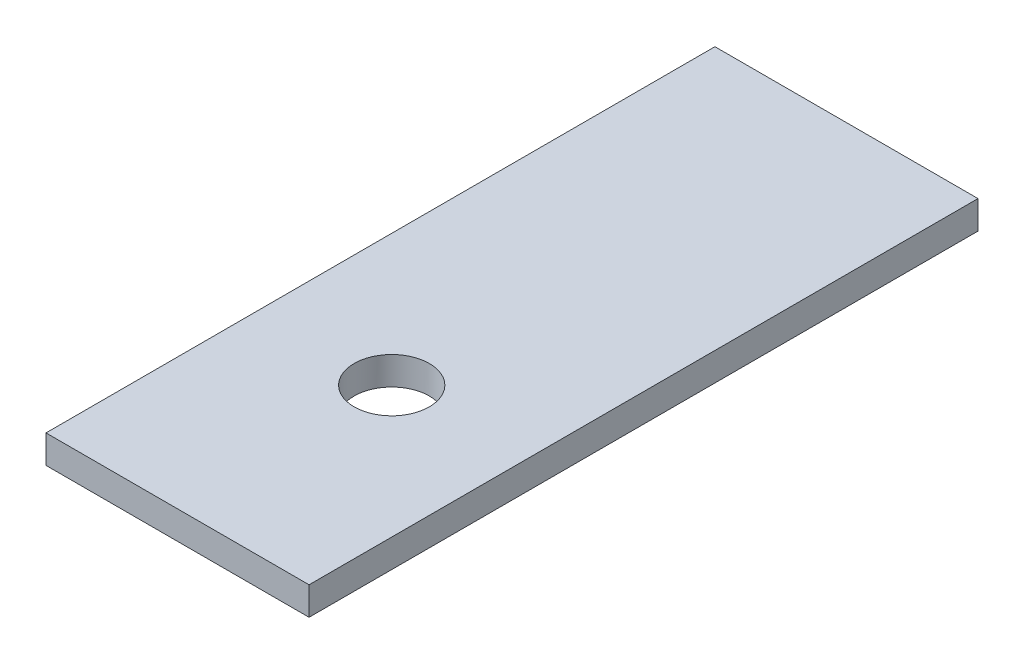
ISO-10303-21;
HEADER;
FILE_DESCRIPTION(('STEP AP214'),'2;1');
FILE_NAME('part.step','',(''),(''),'','','');
FILE_SCHEMA(('AUTOMOTIVE_DESIGN { 1 0 10303 214 1 1 1 1 }'));
ENDSEC;
DATA;
#1=APPLICATION_CONTEXT('core data for automotive mechanical design processes');
#2=APPLICATION_PROTOCOL_DEFINITION('international standard','automotive_design',2000,#1);
#3=PRODUCT_CONTEXT('',#1,'mechanical');
#4=PRODUCT('Part','Part','',(#3));
#5=PRODUCT_RELATED_PRODUCT_CATEGORY('part','',(#4));
#6=PRODUCT_DEFINITION_FORMATION('','',#4);
#7=PRODUCT_DEFINITION_CONTEXT('part definition',#1,'design');
#8=PRODUCT_DEFINITION('design','',#6,#7);
#9=PRODUCT_DEFINITION_SHAPE('','',#8);
#10=(LENGTH_UNIT() NAMED_UNIT(*) SI_UNIT(.MILLI.,.METRE.));
#11=(NAMED_UNIT(*) PLANE_ANGLE_UNIT() SI_UNIT($,.RADIAN.));
#12=(NAMED_UNIT(*) SI_UNIT($,.STERADIAN.) SOLID_ANGLE_UNIT());
#13=UNCERTAINTY_MEASURE_WITH_UNIT(LENGTH_MEASURE(1.E-05),#10,'distance_accuracy_value','');
#14=(GEOMETRIC_REPRESENTATION_CONTEXT(3) GLOBAL_UNCERTAINTY_ASSIGNED_CONTEXT((#13)) GLOBAL_UNIT_ASSIGNED_CONTEXT((#10,
#11,#12)) REPRESENTATION_CONTEXT('',''));
#15=CARTESIAN_POINT('',(0.,0.,0.));
#16=DIRECTION('',(0.,0.,1.));
#17=DIRECTION('',(1.,0.,0.));
#18=AXIS2_PLACEMENT_3D('',#15,#16,#17);
#19=CARTESIAN_POINT('',(14.,3.,35.6));
#20=DIRECTION('',(-1.,0.,0.));
#21=DIRECTION('',(0.,0.,1.));
#22=AXIS2_PLACEMENT_3D('',#19,#20,#21);
#23=PLANE('',#22);
#24=DIRECTION('',(0.,0.,-1.));
#25=VECTOR('',#24,1.);
#26=CARTESIAN_POINT('',(14.,0.,35.6));
#27=LINE('',#26,#25);
#28=CARTESIAN_POINT('',(14.,0.,35.6));
#29=VERTEX_POINT('',#28);
#30=CARTESIAN_POINT('',(14.,0.,-35.6));
#31=VERTEX_POINT('',#30);
#32=EDGE_CURVE('E101',#29,#31,#27,.T.);
#33=ORIENTED_EDGE('',*,*,#32,.T.);
#34=DIRECTION('',(0.,-1.,0.));
#35=VECTOR('',#34,1.);
#36=CARTESIAN_POINT('',(14.,3.,-35.6));
#37=LINE('',#36,#35);
#38=CARTESIAN_POINT('',(14.,3.,-35.6));
#39=VERTEX_POINT('',#38);
#40=EDGE_CURVE('E11',#39,#31,#37,.T.);
#41=ORIENTED_EDGE('',*,*,#40,.F.);
#42=DIRECTION('',(0.,0.,-1.));
#43=VECTOR('',#42,1.);
#44=CARTESIAN_POINT('',(14.,3.,35.6));
#45=LINE('',#44,#43);
#46=CARTESIAN_POINT('',(14.,3.,35.6));
#47=VERTEX_POINT('',#46);
#48=EDGE_CURVE('E88',#47,#39,#45,.T.);
#49=ORIENTED_EDGE('',*,*,#48,.F.);
#50=DIRECTION('',(0.,-1.,0.));
#51=VECTOR('',#50,1.);
#52=CARTESIAN_POINT('',(14.,3.,35.6));
#53=LINE('',#52,#51);
#54=EDGE_CURVE('E97',#47,#29,#53,.T.);
#55=ORIENTED_EDGE('',*,*,#54,.T.);
#56=EDGE_LOOP('',(#33,#41,#49,#55));
#57=FACE_BOUND('',#56,.T.);
#58=ADVANCED_FACE('F36',(#57),#23,.F.);
#59=CARTESIAN_POINT('',(-14.,3.,-35.6));
#60=DIRECTION('',(0.,0.,1.));
#61=DIRECTION('',(1.,0.,0.));
#62=AXIS2_PLACEMENT_3D('',#59,#60,#61);
#63=PLANE('',#62);
#64=DIRECTION('',(-1.,0.,0.));
#65=VECTOR('',#64,1.);
#66=CARTESIAN_POINT('',(-14.,0.,-35.6));
#67=LINE('',#66,#65);
#68=CARTESIAN_POINT('',(-14.,0.,-35.6));
#69=VERTEX_POINT('',#68);
#70=EDGE_CURVE('E92',#31,#69,#67,.T.);
#71=ORIENTED_EDGE('',*,*,#70,.T.);
#72=DIRECTION('',(0.,-1.,0.));
#73=VECTOR('',#72,1.);
#74=CARTESIAN_POINT('',(-14.,3.,-35.6));
#75=LINE('',#74,#73);
#76=CARTESIAN_POINT('',(-14.,3.,-35.6));
#77=VERTEX_POINT('',#76);
#78=EDGE_CURVE('E45',#77,#69,#75,.T.);
#79=ORIENTED_EDGE('',*,*,#78,.F.);
#80=DIRECTION('',(-1.,0.,0.));
#81=VECTOR('',#80,1.);
#82=CARTESIAN_POINT('',(-14.,3.,-35.6));
#83=LINE('',#82,#81);
#84=EDGE_CURVE('E83',#39,#77,#83,.T.);
#85=ORIENTED_EDGE('',*,*,#84,.F.);
#86=ORIENTED_EDGE('',*,*,#40,.T.);
#87=EDGE_LOOP('',(#71,#79,#85,#86));
#88=FACE_BOUND('',#87,.T.);
#89=ADVANCED_FACE('F91',(#88),#63,.F.);
#90=CARTESIAN_POINT('',(-14.,3.,35.6));
#91=DIRECTION('',(1.,0.,0.));
#92=DIRECTION('',(0.,0.,-1.));
#93=AXIS2_PLACEMENT_3D('',#90,#91,#92);
#94=PLANE('',#93);
#95=DIRECTION('',(0.,0.,1.));
#96=VECTOR('',#95,1.);
#97=CARTESIAN_POINT('',(-14.,0.,35.6));
#98=LINE('',#97,#96);
#99=CARTESIAN_POINT('',(-14.,0.,35.6));
#100=VERTEX_POINT('',#99);
#101=EDGE_CURVE('E70',#69,#100,#98,.T.);
#102=ORIENTED_EDGE('',*,*,#101,.T.);
#103=DIRECTION('',(0.,-1.,0.));
#104=VECTOR('',#103,1.);
#105=CARTESIAN_POINT('',(-14.,3.,35.6));
#106=LINE('',#105,#104);
#107=CARTESIAN_POINT('',(-14.,3.,35.6));
#108=VERTEX_POINT('',#107);
#109=EDGE_CURVE('E93',#108,#100,#106,.T.);
#110=ORIENTED_EDGE('',*,*,#109,.F.);
#111=DIRECTION('',(0.,0.,1.));
#112=VECTOR('',#111,1.);
#113=CARTESIAN_POINT('',(-14.,3.,35.6));
#114=LINE('',#113,#112);
#115=EDGE_CURVE('E86',#77,#108,#114,.T.);
#116=ORIENTED_EDGE('',*,*,#115,.F.);
#117=ORIENTED_EDGE('',*,*,#78,.T.);
#118=EDGE_LOOP('',(#102,#110,#116,#117));
#119=FACE_BOUND('',#118,.T.);
#120=ADVANCED_FACE('F95',(#119),#94,.F.);
#121=CARTESIAN_POINT('',(-14.,3.,35.6));
#122=DIRECTION('',(0.,0.,-1.));
#123=DIRECTION('',(-1.,0.,0.));
#124=AXIS2_PLACEMENT_3D('',#121,#122,#123);
#125=PLANE('',#124);
#126=DIRECTION('',(1.,0.,0.));
#127=VECTOR('',#126,1.);
#128=CARTESIAN_POINT('',(-14.,0.,35.6));
#129=LINE('',#128,#127);
#130=EDGE_CURVE('E76',#100,#29,#129,.T.);
#131=ORIENTED_EDGE('',*,*,#130,.T.);
#132=ORIENTED_EDGE('',*,*,#54,.F.);
#133=DIRECTION('',(1.,0.,0.));
#134=VECTOR('',#133,1.);
#135=CARTESIAN_POINT('',(-14.,3.,35.6));
#136=LINE('',#135,#134);
#137=EDGE_CURVE('E53',#108,#47,#136,.T.);
#138=ORIENTED_EDGE('',*,*,#137,.F.);
#139=ORIENTED_EDGE('',*,*,#109,.T.);
#140=EDGE_LOOP('',(#131,#132,#138,#139));
#141=FACE_BOUND('',#140,.T.);
#142=ADVANCED_FACE('F108',(#141),#125,.F.);
#143=CARTESIAN_POINT('',(0.,3.,0.));
#144=DIRECTION('',(0.,-1.,0.));
#145=DIRECTION('',(0.,0.,-1.));
#146=AXIS2_PLACEMENT_3D('',#143,#144,#145);
#147=PLANE('',#146);
#148=CARTESIAN_POINT('',(0.,3.,12.7999999999985));
#149=DIRECTION('',(0.,1.,0.));
#150=DIRECTION('',(0.,0.,1.));
#151=AXIS2_PLACEMENT_3D('',#148,#149,#150);
#152=CIRCLE('',#151,4.);
#153=CARTESIAN_POINT('',(0.,3.,16.7999999999985));
#154=VERTEX_POINT('',#153);
#155=EDGE_CURVE('E114',#154,#154,#152,.T.);
#156=ORIENTED_EDGE('',*,*,#155,.F.);
#157=EDGE_LOOP('',(#156));
#158=FACE_BOUND('',#157,.T.);
#159=ORIENTED_EDGE('',*,*,#48,.T.);
#160=ORIENTED_EDGE('',*,*,#84,.T.);
#161=ORIENTED_EDGE('',*,*,#115,.T.);
#162=ORIENTED_EDGE('',*,*,#137,.T.);
#163=EDGE_LOOP('',(#159,#160,#161,#162));
#164=FACE_BOUND('',#163,.T.);
#165=ADVANCED_FACE('F84',(#158,#164),#147,.F.);
#166=CARTESIAN_POINT('',(0.,0.,0.));
#167=DIRECTION('',(0.,-1.,0.));
#168=DIRECTION('',(0.,0.,-1.));
#169=AXIS2_PLACEMENT_3D('',#166,#167,#168);
#170=PLANE('',#169);
#171=CARTESIAN_POINT('',(0.,0.,12.7999999999985));
#172=DIRECTION('',(0.,-1.,0.));
#173=DIRECTION('',(0.,0.,-1.));
#174=AXIS2_PLACEMENT_3D('',#171,#172,#173);
#175=CIRCLE('',#174,4.);
#176=CARTESIAN_POINT('',(0.,0.,8.79999999999852));
#177=VERTEX_POINT('',#176);
#178=EDGE_CURVE('E39',#177,#177,#175,.T.);
#179=ORIENTED_EDGE('',*,*,#178,.F.);
#180=EDGE_LOOP('',(#179));
#181=FACE_BOUND('',#180,.T.);
#182=ORIENTED_EDGE('',*,*,#32,.F.);
#183=ORIENTED_EDGE('',*,*,#130,.F.);
#184=ORIENTED_EDGE('',*,*,#101,.F.);
#185=ORIENTED_EDGE('',*,*,#70,.F.);
#186=EDGE_LOOP('',(#182,#183,#184,#185));
#187=FACE_BOUND('',#186,.T.);
#188=ADVANCED_FACE('F111',(#181,#187),#170,.T.);
#189=CARTESIAN_POINT('',(0.,-7.,12.7999999999985));
#190=DIRECTION('',(0.,1.,0.));
#191=DIRECTION('',(0.,0.,1.));
#192=AXIS2_PLACEMENT_3D('',#189,#190,#191);
#193=CYLINDRICAL_SURFACE('',#192,4.);
#194=ORIENTED_EDGE('',*,*,#178,.T.);
#195=EDGE_LOOP('',(#194));
#196=FACE_BOUND('',#195,.T.);
#197=ORIENTED_EDGE('',*,*,#155,.T.);
#198=EDGE_LOOP('',(#197));
#199=FACE_BOUND('',#198,.T.);
#200=ADVANCED_FACE('F121',(#196,#199),#193,.F.);
#201=CLOSED_SHELL('',(#58,#89,#120,#142,#165,#188,#200));
#202=MANIFOLD_SOLID_BREP('B2',#201);
#203=ADVANCED_BREP_SHAPE_REPRESENTATION('',(#18,#202),#14);
#204=SHAPE_DEFINITION_REPRESENTATION(#9,#203);
ENDSEC;
END-ISO-10303-21;
